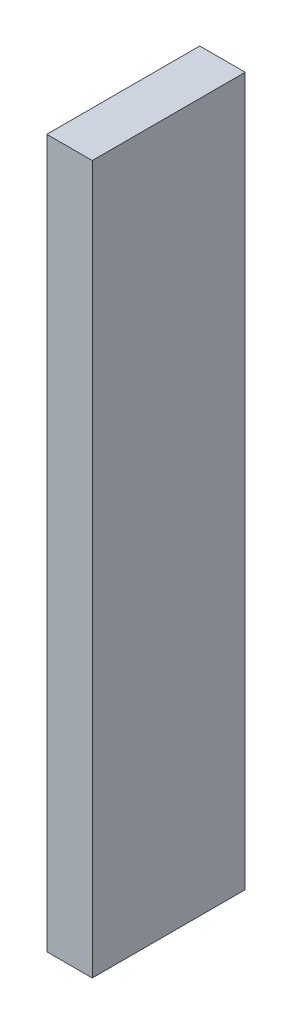
ISO-10303-21;
HEADER;
FILE_DESCRIPTION(('STEP AP214'),'2;1');
FILE_NAME('part.step','',(''),(''),'','','');
FILE_SCHEMA(('AUTOMOTIVE_DESIGN { 1 0 10303 214 1 1 1 1 }'));
ENDSEC;
DATA;
#1=APPLICATION_CONTEXT('core data for automotive mechanical design processes');
#2=APPLICATION_PROTOCOL_DEFINITION('international standard','automotive_design',2000,#1);
#3=PRODUCT_CONTEXT('',#1,'mechanical');
#4=PRODUCT('Part','Part','',(#3));
#5=PRODUCT_RELATED_PRODUCT_CATEGORY('part','',(#4));
#6=PRODUCT_DEFINITION_FORMATION('','',#4);
#7=PRODUCT_DEFINITION_CONTEXT('part definition',#1,'design');
#8=PRODUCT_DEFINITION('design','',#6,#7);
#9=PRODUCT_DEFINITION_SHAPE('','',#8);
#10=(LENGTH_UNIT() NAMED_UNIT(*) SI_UNIT(.MILLI.,.METRE.));
#11=(NAMED_UNIT(*) PLANE_ANGLE_UNIT() SI_UNIT($,.RADIAN.));
#12=(NAMED_UNIT(*) SI_UNIT($,.STERADIAN.) SOLID_ANGLE_UNIT());
#13=UNCERTAINTY_MEASURE_WITH_UNIT(LENGTH_MEASURE(1.E-05),#10,'distance_accuracy_value','');
#14=(GEOMETRIC_REPRESENTATION_CONTEXT(3) GLOBAL_UNCERTAINTY_ASSIGNED_CONTEXT((#13)) GLOBAL_UNIT_ASSIGNED_CONTEXT((#10,
#11,#12)) REPRESENTATION_CONTEXT('',''));
#15=CARTESIAN_POINT('',(0.,0.,0.));
#16=DIRECTION('',(0.,0.,1.));
#17=DIRECTION('',(1.,0.,0.));
#18=AXIS2_PLACEMENT_3D('',#15,#16,#17);
#19=CARTESIAN_POINT('',(130.275545153243,22.4180708263693,121.072028202897));
#20=DIRECTION('',(-1.69244514382854E-09,0.,1.));
#21=DIRECTION('',(1.,0.,1.69244514382854E-09));
#22=AXIS2_PLACEMENT_3D('',#19,#20,#21);
#23=PLANE('',#22);
#24=DIRECTION('',(0.,-1.,0.));
#25=VECTOR('',#24,1.);
#26=CARTESIAN_POINT('',(131.258630250256,22.4180708263693,121.072028204561));
#27=LINE('',#26,#25);
#28=CARTESIAN_POINT('',(131.258630250256,22.4180708263693,121.072028204561));
#29=VERTEX_POINT('',#28);
#30=CARTESIAN_POINT('',(131.258630250256,7.11212965552235,121.072028204561));
#31=VERTEX_POINT('',#30);
#32=EDGE_CURVE('E79',#29,#31,#27,.T.);
#33=ORIENTED_EDGE('',*,*,#32,.F.);
#34=DIRECTION('',(1.,0.,1.69244514382854E-09));
#35=VECTOR('',#34,1.);
#36=CARTESIAN_POINT('',(130.275545153243,22.4180708263693,121.072028202897));
#37=LINE('',#36,#35);
#38=CARTESIAN_POINT('',(130.275545153243,22.4180708263693,121.072028202897));
#39=VERTEX_POINT('',#38);
#40=EDGE_CURVE('E32',#39,#29,#37,.T.);
#41=ORIENTED_EDGE('',*,*,#40,.F.);
#42=DIRECTION('',(0.,-1.,0.));
#43=VECTOR('',#42,1.);
#44=CARTESIAN_POINT('',(130.275545153243,22.4180708263693,121.072028202897));
#45=LINE('',#44,#43);
#46=CARTESIAN_POINT('',(130.275545153243,7.11212965552235,121.072028202897));
#47=VERTEX_POINT('',#46);
#48=EDGE_CURVE('E71',#39,#47,#45,.T.);
#49=ORIENTED_EDGE('',*,*,#48,.T.);
#50=DIRECTION('',(1.,0.,1.69244514382854E-09));
#51=VECTOR('',#50,1.);
#52=CARTESIAN_POINT('',(130.275545153243,7.11212965552235,121.072028202897));
#53=LINE('',#52,#51);
#54=EDGE_CURVE('E10',#47,#31,#53,.T.);
#55=ORIENTED_EDGE('',*,*,#54,.T.);
#56=EDGE_LOOP('',(#33,#41,#49,#55));
#57=FACE_BOUND('',#56,.T.);
#58=ADVANCED_FACE('F16',(#57),#23,.T.);
#59=CARTESIAN_POINT('',(130.275545153243,7.11212965552235,121.072028202897));
#60=DIRECTION('',(0.,-1.,0.));
#61=DIRECTION('',(0.,0.,-1.));
#62=AXIS2_PLACEMENT_3D('',#59,#60,#61);
#63=PLANE('',#62);
#64=DIRECTION('',(1.69244514382854E-09,0.,-1.));
#65=VECTOR('',#64,1.);
#66=CARTESIAN_POINT('',(131.258630250256,7.11212965552235,121.072028204561));
#67=LINE('',#66,#65);
#68=CARTESIAN_POINT('',(131.258630255852,7.11212965552235,117.766087033712));
#69=VERTEX_POINT('',#68);
#70=EDGE_CURVE('E82',#31,#69,#67,.T.);
#71=ORIENTED_EDGE('',*,*,#70,.F.);
#72=ORIENTED_EDGE('',*,*,#54,.F.);
#73=DIRECTION('',(1.69244514382854E-09,0.,-1.));
#74=VECTOR('',#73,1.);
#75=CARTESIAN_POINT('',(130.275545153243,7.11212965552235,121.072028202897));
#76=LINE('',#75,#74);
#77=CARTESIAN_POINT('',(130.275545158838,7.11212965552235,117.766087032048));
#78=VERTEX_POINT('',#77);
#79=EDGE_CURVE('E67',#47,#78,#76,.T.);
#80=ORIENTED_EDGE('',*,*,#79,.T.);
#81=DIRECTION('',(1.,0.,1.69244514382854E-09));
#82=VECTOR('',#81,1.);
#83=CARTESIAN_POINT('',(130.275545158838,7.11212965552235,117.766087032048));
#84=LINE('',#83,#82);
#85=EDGE_CURVE('E24',#78,#69,#84,.T.);
#86=ORIENTED_EDGE('',*,*,#85,.T.);
#87=EDGE_LOOP('',(#71,#72,#80,#86));
#88=FACE_BOUND('',#87,.T.);
#89=ADVANCED_FACE('F68',(#88),#63,.T.);
#90=CARTESIAN_POINT('',(130.275545158838,7.11212965552235,117.766087032048));
#91=DIRECTION('',(1.69244514382854E-09,0.,-1.));
#92=DIRECTION('',(-1.,0.,-1.69244514382854E-09));
#93=AXIS2_PLACEMENT_3D('',#90,#91,#92);
#94=PLANE('',#93);
#95=DIRECTION('',(0.,1.,0.));
#96=VECTOR('',#95,1.);
#97=CARTESIAN_POINT('',(131.258630255852,7.11212965552235,117.766087033712));
#98=LINE('',#97,#96);
#99=CARTESIAN_POINT('',(131.258630255852,22.418070826371,117.766087025251));
#100=VERTEX_POINT('',#99);
#101=EDGE_CURVE('E65',#69,#100,#98,.T.);
#102=ORIENTED_EDGE('',*,*,#101,.F.);
#103=ORIENTED_EDGE('',*,*,#85,.F.);
#104=DIRECTION('',(0.,1.,0.));
#105=VECTOR('',#104,1.);
#106=CARTESIAN_POINT('',(130.275545158838,7.11212965552235,117.766087032048));
#107=LINE('',#106,#105);
#108=CARTESIAN_POINT('',(130.275545158838,22.418070826371,117.766087023588));
#109=VERTEX_POINT('',#108);
#110=EDGE_CURVE('E62',#78,#109,#107,.T.);
#111=ORIENTED_EDGE('',*,*,#110,.T.);
#112=DIRECTION('',(1.,0.,1.69244514382854E-09));
#113=VECTOR('',#112,1.);
#114=CARTESIAN_POINT('',(130.275545158838,22.418070826371,117.766087023588));
#115=LINE('',#114,#113);
#116=EDGE_CURVE('E48',#109,#100,#115,.T.);
#117=ORIENTED_EDGE('',*,*,#116,.T.);
#118=EDGE_LOOP('',(#102,#103,#111,#117));
#119=FACE_BOUND('',#118,.T.);
#120=ADVANCED_FACE('F60',(#119),#94,.T.);
#121=CARTESIAN_POINT('',(130.275545158838,22.418070826371,117.766087023588));
#122=DIRECTION('',(0.,1.,0.));
#123=DIRECTION('',(-1.,0.,0.));
#124=AXIS2_PLACEMENT_3D('',#121,#122,#123);
#125=PLANE('',#124);
#126=DIRECTION('',(-1.69244514382854E-09,0.,1.));
#127=VECTOR('',#126,1.);
#128=CARTESIAN_POINT('',(131.258630255852,22.418070826371,117.766087025251));
#129=LINE('',#128,#127);
#130=EDGE_CURVE('E85',#100,#29,#129,.T.);
#131=ORIENTED_EDGE('',*,*,#130,.F.);
#132=ORIENTED_EDGE('',*,*,#116,.F.);
#133=DIRECTION('',(-1.69244514382854E-09,0.,1.));
#134=VECTOR('',#133,1.);
#135=CARTESIAN_POINT('',(130.275545158838,22.418070826371,117.766087023588));
#136=LINE('',#135,#134);
#137=EDGE_CURVE('E74',#109,#39,#136,.T.);
#138=ORIENTED_EDGE('',*,*,#137,.T.);
#139=ORIENTED_EDGE('',*,*,#40,.T.);
#140=EDGE_LOOP('',(#131,#132,#138,#139));
#141=FACE_BOUND('',#140,.T.);
#142=ADVANCED_FACE('F96',(#141),#125,.T.);
#143=CARTESIAN_POINT('',(130.275545201028,17.2651002409467,92.8378644340291));
#144=DIRECTION('',(1.,0.,1.69244514382854E-09));
#145=DIRECTION('',(0.,1.,0.));
#146=AXIS2_PLACEMENT_3D('',#143,#144,#145);
#147=PLANE('',#146);
#148=ORIENTED_EDGE('',*,*,#48,.F.);
#149=ORIENTED_EDGE('',*,*,#137,.F.);
#150=ORIENTED_EDGE('',*,*,#110,.F.);
#151=ORIENTED_EDGE('',*,*,#79,.F.);
#152=EDGE_LOOP('',(#148,#149,#150,#151));
#153=FACE_BOUND('',#152,.T.);
#154=ADVANCED_FACE('F73',(#153),#147,.F.);
#155=CARTESIAN_POINT('',(131.258630298041,17.2651002409467,92.8378644356929));
#156=DIRECTION('',(1.,0.,1.69244514382854E-09));
#157=DIRECTION('',(0.,1.,0.));
#158=AXIS2_PLACEMENT_3D('',#155,#156,#157);
#159=PLANE('',#158);
#160=ORIENTED_EDGE('',*,*,#32,.T.);
#161=ORIENTED_EDGE('',*,*,#70,.T.);
#162=ORIENTED_EDGE('',*,*,#101,.T.);
#163=ORIENTED_EDGE('',*,*,#130,.T.);
#164=EDGE_LOOP('',(#160,#161,#162,#163));
#165=FACE_BOUND('',#164,.T.);
#166=ADVANCED_FACE('F89',(#165),#159,.T.);
#167=CLOSED_SHELL('',(#58,#89,#120,#142,#154,#166));
#168=MANIFOLD_SOLID_BREP('B1',#167);
#169=ADVANCED_BREP_SHAPE_REPRESENTATION('',(#18,#168),#14);
#170=SHAPE_DEFINITION_REPRESENTATION(#9,#169);
ENDSEC;
END-ISO-10303-21;
